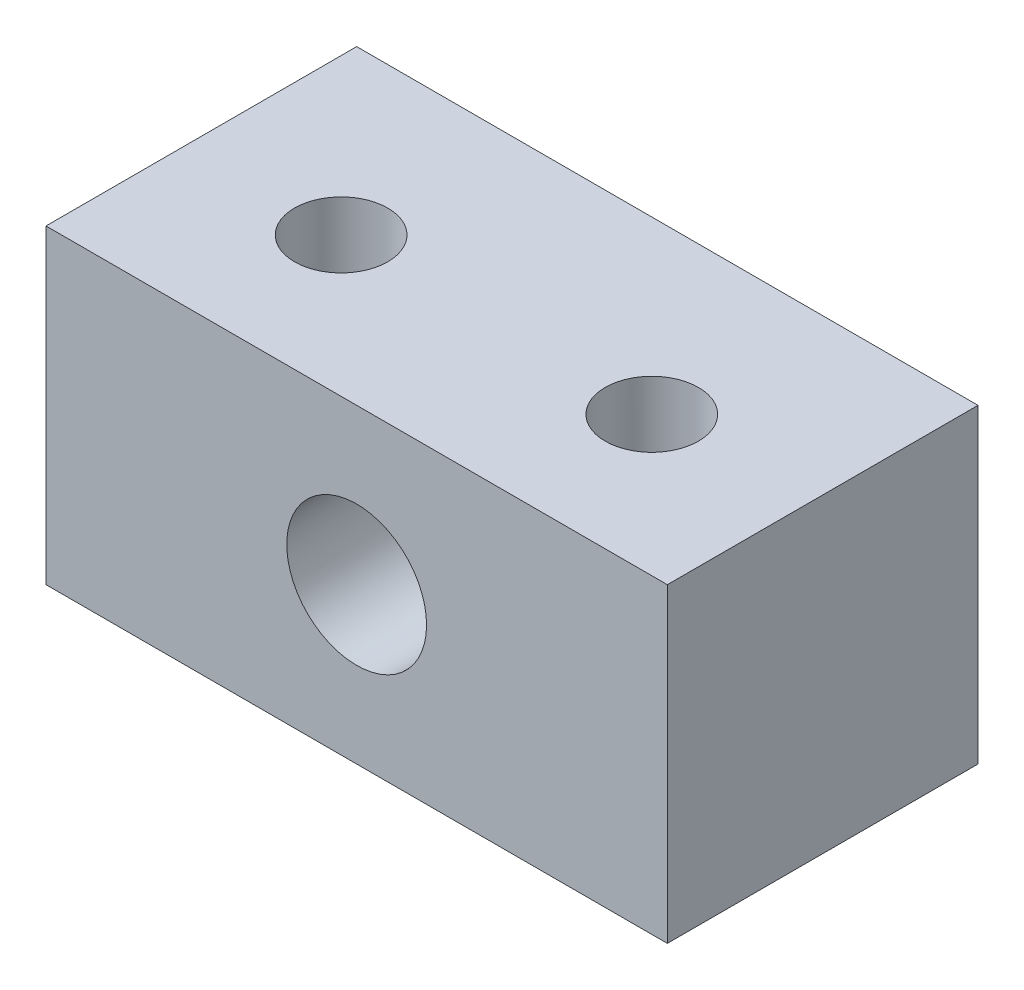
ISO-10303-21;
HEADER;
FILE_DESCRIPTION(('STEP AP214'),'2;1');
FILE_NAME('part.step','',(''),(''),'','','');
FILE_SCHEMA(('AUTOMOTIVE_DESIGN { 1 0 10303 214 1 1 1 1 }'));
ENDSEC;
DATA;
#1=APPLICATION_CONTEXT('core data for automotive mechanical design processes');
#2=APPLICATION_PROTOCOL_DEFINITION('international standard','automotive_design',2000,#1);
#3=PRODUCT_CONTEXT('',#1,'mechanical');
#4=PRODUCT('Part','Part','',(#3));
#5=PRODUCT_RELATED_PRODUCT_CATEGORY('part','',(#4));
#6=PRODUCT_DEFINITION_FORMATION('','',#4);
#7=PRODUCT_DEFINITION_CONTEXT('part definition',#1,'design');
#8=PRODUCT_DEFINITION('design','',#6,#7);
#9=PRODUCT_DEFINITION_SHAPE('','',#8);
#10=(LENGTH_UNIT() NAMED_UNIT(*) SI_UNIT(.MILLI.,.METRE.));
#11=(NAMED_UNIT(*) PLANE_ANGLE_UNIT() SI_UNIT($,.RADIAN.));
#12=(NAMED_UNIT(*) SI_UNIT($,.STERADIAN.) SOLID_ANGLE_UNIT());
#13=UNCERTAINTY_MEASURE_WITH_UNIT(LENGTH_MEASURE(1.E-05),#10,'distance_accuracy_value','');
#14=(GEOMETRIC_REPRESENTATION_CONTEXT(3) GLOBAL_UNCERTAINTY_ASSIGNED_CONTEXT((#13)) GLOBAL_UNIT_ASSIGNED_CONTEXT((#10,
#11,#12)) REPRESENTATION_CONTEXT('',''));
#15=CARTESIAN_POINT('',(0.,0.,0.));
#16=DIRECTION('',(0.,0.,1.));
#17=DIRECTION('',(1.,0.,0.));
#18=AXIS2_PLACEMENT_3D('',#15,#16,#17);
#19=CARTESIAN_POINT('',(0.,10.,10.));
#20=DIRECTION('',(1.,0.,0.));
#21=DIRECTION('',(0.,1.,0.));
#22=AXIS2_PLACEMENT_3D('',#19,#20,#21);
#23=PLANE('',#22);
#24=DIRECTION('',(0.,-1.,0.));
#25=VECTOR('',#24,1.);
#26=CARTESIAN_POINT('',(0.,10.,0.));
#27=LINE('',#26,#25);
#28=CARTESIAN_POINT('',(0.,10.,0.));
#29=VERTEX_POINT('',#28);
#30=CARTESIAN_POINT('',(0.,0.,0.));
#31=VERTEX_POINT('',#30);
#32=EDGE_CURVE('E98',#29,#31,#27,.T.);
#33=ORIENTED_EDGE('',*,*,#32,.T.);
#34=DIRECTION('',(0.,0.,-1.));
#35=VECTOR('',#34,1.);
#36=CARTESIAN_POINT('',(0.,0.,10.));
#37=LINE('',#36,#35);
#38=CARTESIAN_POINT('',(0.,0.,10.));
#39=VERTEX_POINT('',#38);
#40=EDGE_CURVE('E11',#39,#31,#37,.T.);
#41=ORIENTED_EDGE('',*,*,#40,.F.);
#42=DIRECTION('',(0.,-1.,0.));
#43=VECTOR('',#42,1.);
#44=CARTESIAN_POINT('',(0.,10.,10.));
#45=LINE('',#44,#43);
#46=CARTESIAN_POINT('',(0.,10.,10.));
#47=VERTEX_POINT('',#46);
#48=EDGE_CURVE('E85',#47,#39,#45,.T.);
#49=ORIENTED_EDGE('',*,*,#48,.F.);
#50=DIRECTION('',(0.,0.,-1.));
#51=VECTOR('',#50,1.);
#52=CARTESIAN_POINT('',(0.,10.,10.));
#53=LINE('',#52,#51);
#54=EDGE_CURVE('E94',#47,#29,#53,.T.);
#55=ORIENTED_EDGE('',*,*,#54,.T.);
#56=EDGE_LOOP('',(#33,#41,#49,#55));
#57=FACE_BOUND('',#56,.T.);
#58=ADVANCED_FACE('F32',(#57),#23,.F.);
#59=CARTESIAN_POINT('',(0.,0.,10.));
#60=DIRECTION('',(0.,1.,0.));
#61=DIRECTION('',(0.,0.,1.));
#62=AXIS2_PLACEMENT_3D('',#59,#60,#61);
#63=PLANE('',#62);
#64=CARTESIAN_POINT('',(15.,0.,5.5));
#65=DIRECTION('',(0.,1.,0.));
#66=DIRECTION('',(0.,0.,1.));
#67=AXIS2_PLACEMENT_3D('',#64,#65,#66);
#68=CIRCLE('',#67,1.5);
#69=CARTESIAN_POINT('',(15.,0.,7.));
#70=VERTEX_POINT('',#69);
#71=EDGE_CURVE('E119',#70,#70,#68,.T.);
#72=ORIENTED_EDGE('',*,*,#71,.T.);
#73=EDGE_LOOP('',(#72));
#74=FACE_BOUND('',#73,.T.);
#75=CARTESIAN_POINT('',(5.,0.,5.5));
#76=DIRECTION('',(0.,1.,0.));
#77=DIRECTION('',(0.,0.,1.));
#78=AXIS2_PLACEMENT_3D('',#75,#76,#77);
#79=CIRCLE('',#78,1.5);
#80=CARTESIAN_POINT('',(5.,0.,7.));
#81=VERTEX_POINT('',#80);
#82=EDGE_CURVE('E109',#81,#81,#79,.T.);
#83=ORIENTED_EDGE('',*,*,#82,.T.);
#84=EDGE_LOOP('',(#83));
#85=FACE_BOUND('',#84,.T.);
#86=DIRECTION('',(1.,0.,0.));
#87=VECTOR('',#86,1.);
#88=CARTESIAN_POINT('',(0.,0.,0.));
#89=LINE('',#88,#87);
#90=CARTESIAN_POINT('',(20.,0.,0.));
#91=VERTEX_POINT('',#90);
#92=EDGE_CURVE('E89',#31,#91,#89,.T.);
#93=ORIENTED_EDGE('',*,*,#92,.T.);
#94=DIRECTION('',(0.,0.,-1.));
#95=VECTOR('',#94,1.);
#96=CARTESIAN_POINT('',(20.,0.,10.));
#97=LINE('',#96,#95);
#98=CARTESIAN_POINT('',(20.,0.,10.));
#99=VERTEX_POINT('',#98);
#100=EDGE_CURVE('E41',#99,#91,#97,.T.);
#101=ORIENTED_EDGE('',*,*,#100,.F.);
#102=DIRECTION('',(1.,0.,0.));
#103=VECTOR('',#102,1.);
#104=CARTESIAN_POINT('',(0.,0.,10.));
#105=LINE('',#104,#103);
#106=EDGE_CURVE('E80',#39,#99,#105,.T.);
#107=ORIENTED_EDGE('',*,*,#106,.F.);
#108=ORIENTED_EDGE('',*,*,#40,.T.);
#109=EDGE_LOOP('',(#93,#101,#107,#108));
#110=FACE_BOUND('',#109,.T.);
#111=ADVANCED_FACE('F88',(#74,#85,#110),#63,.F.);
#112=CARTESIAN_POINT('',(20.,10.,10.));
#113=DIRECTION('',(-1.,0.,0.));
#114=DIRECTION('',(0.,0.,1.));
#115=AXIS2_PLACEMENT_3D('',#112,#113,#114);
#116=PLANE('',#115);
#117=DIRECTION('',(0.,1.,0.));
#118=VECTOR('',#117,1.);
#119=CARTESIAN_POINT('',(20.,10.,0.));
#120=LINE('',#119,#118);
#121=CARTESIAN_POINT('',(20.,10.,0.));
#122=VERTEX_POINT('',#121);
#123=EDGE_CURVE('E67',#91,#122,#120,.T.);
#124=ORIENTED_EDGE('',*,*,#123,.T.);
#125=DIRECTION('',(0.,0.,-1.));
#126=VECTOR('',#125,1.);
#127=CARTESIAN_POINT('',(20.,10.,10.));
#128=LINE('',#127,#126);
#129=CARTESIAN_POINT('',(20.,10.,10.));
#130=VERTEX_POINT('',#129);
#131=EDGE_CURVE('E90',#130,#122,#128,.T.);
#132=ORIENTED_EDGE('',*,*,#131,.F.);
#133=DIRECTION('',(0.,1.,0.));
#134=VECTOR('',#133,1.);
#135=CARTESIAN_POINT('',(20.,10.,10.));
#136=LINE('',#135,#134);
#137=EDGE_CURVE('E83',#99,#130,#136,.T.);
#138=ORIENTED_EDGE('',*,*,#137,.F.);
#139=ORIENTED_EDGE('',*,*,#100,.T.);
#140=EDGE_LOOP('',(#124,#132,#138,#139));
#141=FACE_BOUND('',#140,.T.);
#142=ADVANCED_FACE('F92',(#141),#116,.F.);
#143=CARTESIAN_POINT('',(0.,10.,10.));
#144=DIRECTION('',(0.,-1.,0.));
#145=DIRECTION('',(0.,0.,-1.));
#146=AXIS2_PLACEMENT_3D('',#143,#144,#145);
#147=PLANE('',#146);
#148=CARTESIAN_POINT('',(15.,10.,5.5));
#149=DIRECTION('',(0.,-1.,0.));
#150=DIRECTION('',(0.,0.,-1.));
#151=AXIS2_PLACEMENT_3D('',#148,#149,#150);
#152=CIRCLE('',#151,1.5);
#153=CARTESIAN_POINT('',(15.,10.,4.));
#154=VERTEX_POINT('',#153);
#155=EDGE_CURVE('E35',#154,#154,#152,.T.);
#156=ORIENTED_EDGE('',*,*,#155,.T.);
#157=EDGE_LOOP('',(#156));
#158=FACE_BOUND('',#157,.T.);
#159=CARTESIAN_POINT('',(5.,10.,5.5));
#160=DIRECTION('',(0.,-1.,0.));
#161=DIRECTION('',(0.,0.,-1.));
#162=AXIS2_PLACEMENT_3D('',#159,#160,#161);
#163=CIRCLE('',#162,1.5);
#164=CARTESIAN_POINT('',(5.,10.,4.));
#165=VERTEX_POINT('',#164);
#166=EDGE_CURVE('E106',#165,#165,#163,.T.);
#167=ORIENTED_EDGE('',*,*,#166,.T.);
#168=EDGE_LOOP('',(#167));
#169=FACE_BOUND('',#168,.T.);
#170=DIRECTION('',(-1.,0.,0.));
#171=VECTOR('',#170,1.);
#172=CARTESIAN_POINT('',(0.,10.,0.));
#173=LINE('',#172,#171);
#174=EDGE_CURVE('E73',#122,#29,#173,.T.);
#175=ORIENTED_EDGE('',*,*,#174,.T.);
#176=ORIENTED_EDGE('',*,*,#54,.F.);
#177=DIRECTION('',(-1.,0.,0.));
#178=VECTOR('',#177,1.);
#179=CARTESIAN_POINT('',(0.,10.,10.));
#180=LINE('',#179,#178);
#181=EDGE_CURVE('E50',#130,#47,#180,.T.);
#182=ORIENTED_EDGE('',*,*,#181,.F.);
#183=ORIENTED_EDGE('',*,*,#131,.T.);
#184=EDGE_LOOP('',(#175,#176,#182,#183));
#185=FACE_BOUND('',#184,.T.);
#186=ADVANCED_FACE('F136',(#158,#169,#185),#147,.F.);
#187=CARTESIAN_POINT('',(0.,0.,10.));
#188=DIRECTION('',(0.,0.,1.));
#189=DIRECTION('',(1.,0.,0.));
#190=AXIS2_PLACEMENT_3D('',#187,#188,#189);
#191=PLANE('',#190);
#192=CARTESIAN_POINT('',(10.,5.,10.));
#193=DIRECTION('',(0.,0.,1.));
#194=DIRECTION('',(1.,0.,0.));
#195=AXIS2_PLACEMENT_3D('',#192,#193,#194);
#196=CIRCLE('',#195,2.25);
#197=CARTESIAN_POINT('',(12.25,5.,10.));
#198=VERTEX_POINT('',#197);
#199=EDGE_CURVE('E108',#198,#198,#196,.T.);
#200=ORIENTED_EDGE('',*,*,#199,.F.);
#201=EDGE_LOOP('',(#200));
#202=FACE_BOUND('',#201,.T.);
#203=ORIENTED_EDGE('',*,*,#48,.T.);
#204=ORIENTED_EDGE('',*,*,#106,.T.);
#205=ORIENTED_EDGE('',*,*,#137,.T.);
#206=ORIENTED_EDGE('',*,*,#181,.T.);
#207=EDGE_LOOP('',(#203,#204,#205,#206));
#208=FACE_BOUND('',#207,.T.);
#209=ADVANCED_FACE('F81',(#202,#208),#191,.T.);
#210=CARTESIAN_POINT('',(0.,0.,0.));
#211=DIRECTION('',(0.,0.,1.));
#212=DIRECTION('',(1.,0.,0.));
#213=AXIS2_PLACEMENT_3D('',#210,#211,#212);
#214=PLANE('',#213);
#215=CARTESIAN_POINT('',(10.,5.,0.));
#216=DIRECTION('',(0.,0.,1.));
#217=DIRECTION('',(1.,0.,0.));
#218=AXIS2_PLACEMENT_3D('',#215,#216,#217);
#219=CIRCLE('',#218,2.25);
#220=CARTESIAN_POINT('',(12.25,5.,0.));
#221=VERTEX_POINT('',#220);
#222=EDGE_CURVE('E101',#221,#221,#219,.T.);
#223=ORIENTED_EDGE('',*,*,#222,.T.);
#224=EDGE_LOOP('',(#223));
#225=FACE_BOUND('',#224,.T.);
#226=ORIENTED_EDGE('',*,*,#32,.F.);
#227=ORIENTED_EDGE('',*,*,#174,.F.);
#228=ORIENTED_EDGE('',*,*,#123,.F.);
#229=ORIENTED_EDGE('',*,*,#92,.F.);
#230=EDGE_LOOP('',(#226,#227,#228,#229));
#231=FACE_BOUND('',#230,.T.);
#232=ADVANCED_FACE('F125',(#225,#231),#214,.F.);
#233=CARTESIAN_POINT('',(10.,5.,0.));
#234=DIRECTION('',(0.,0.,1.));
#235=DIRECTION('',(1.,0.,0.));
#236=AXIS2_PLACEMENT_3D('',#233,#234,#235);
#237=CYLINDRICAL_SURFACE('',#236,2.25);
#238=ORIENTED_EDGE('',*,*,#222,.F.);
#239=EDGE_LOOP('',(#238));
#240=FACE_BOUND('',#239,.T.);
#241=ORIENTED_EDGE('',*,*,#199,.T.);
#242=EDGE_LOOP('',(#241));
#243=FACE_BOUND('',#242,.T.);
#244=ADVANCED_FACE('F128',(#240,#243),#237,.F.);
#245=CARTESIAN_POINT('',(5.,0.,5.5));
#246=DIRECTION('',(0.,1.,0.));
#247=DIRECTION('',(0.,0.,1.));
#248=AXIS2_PLACEMENT_3D('',#245,#246,#247);
#249=CYLINDRICAL_SURFACE('',#248,1.5);
#250=ORIENTED_EDGE('',*,*,#82,.F.);
#251=EDGE_LOOP('',(#250));
#252=FACE_BOUND('',#251,.T.);
#253=ORIENTED_EDGE('',*,*,#166,.F.);
#254=EDGE_LOOP('',(#253));
#255=FACE_BOUND('',#254,.T.);
#256=ADVANCED_FACE('F131',(#252,#255),#249,.F.);
#257=CARTESIAN_POINT('',(15.,0.,5.5));
#258=DIRECTION('',(0.,1.,0.));
#259=DIRECTION('',(0.,0.,1.));
#260=AXIS2_PLACEMENT_3D('',#257,#258,#259);
#261=CYLINDRICAL_SURFACE('',#260,1.5);
#262=ORIENTED_EDGE('',*,*,#71,.F.);
#263=EDGE_LOOP('',(#262));
#264=FACE_BOUND('',#263,.T.);
#265=ORIENTED_EDGE('',*,*,#155,.F.);
#266=EDGE_LOOP('',(#265));
#267=FACE_BOUND('',#266,.T.);
#268=ADVANCED_FACE('F161',(#264,#267),#261,.F.);
#269=CLOSED_SHELL('',(#58,#111,#142,#186,#209,#232,#244,#256,#268));
#270=MANIFOLD_SOLID_BREP('B2',#269);
#271=ADVANCED_BREP_SHAPE_REPRESENTATION('',(#18,#270),#14);
#272=SHAPE_DEFINITION_REPRESENTATION(#9,#271);
ENDSEC;
END-ISO-10303-21;
